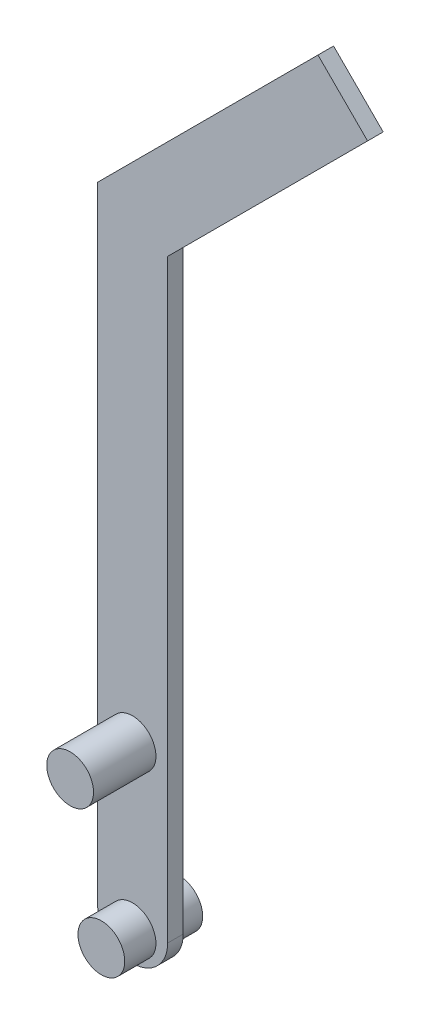
ISO-10303-21;
HEADER;
FILE_DESCRIPTION(('STEP AP214'),'2;1');
FILE_NAME('part.step','',(''),(''),'','','');
FILE_SCHEMA(('AUTOMOTIVE_DESIGN { 1 0 10303 214 1 1 1 1 }'));
ENDSEC;
DATA;
#1=APPLICATION_CONTEXT('core data for automotive mechanical design processes');
#2=APPLICATION_PROTOCOL_DEFINITION('international standard','automotive_design',2000,#1);
#3=PRODUCT_CONTEXT('',#1,'mechanical');
#4=PRODUCT('Part','Part','',(#3));
#5=PRODUCT_RELATED_PRODUCT_CATEGORY('part','',(#4));
#6=PRODUCT_DEFINITION_FORMATION('','',#4);
#7=PRODUCT_DEFINITION_CONTEXT('part definition',#1,'design');
#8=PRODUCT_DEFINITION('design','',#6,#7);
#9=PRODUCT_DEFINITION_SHAPE('','',#8);
#10=(LENGTH_UNIT() NAMED_UNIT(*) SI_UNIT(.MILLI.,.METRE.));
#11=(NAMED_UNIT(*) PLANE_ANGLE_UNIT() SI_UNIT($,.RADIAN.));
#12=(NAMED_UNIT(*) SI_UNIT($,.STERADIAN.) SOLID_ANGLE_UNIT());
#13=UNCERTAINTY_MEASURE_WITH_UNIT(LENGTH_MEASURE(1.E-05),#10,'distance_accuracy_value','');
#14=(GEOMETRIC_REPRESENTATION_CONTEXT(3) GLOBAL_UNCERTAINTY_ASSIGNED_CONTEXT((#13)) GLOBAL_UNIT_ASSIGNED_CONTEXT((#10,
#11,#12)) REPRESENTATION_CONTEXT('',''));
#15=CARTESIAN_POINT('',(0.,0.,0.));
#16=DIRECTION('',(0.,0.,1.));
#17=DIRECTION('',(1.,0.,0.));
#18=AXIS2_PLACEMENT_3D('',#15,#16,#17);
#19=CARTESIAN_POINT('',(-8.77973143237245,-137.007703282967,3.41623708948377));
#20=DIRECTION('',(0.,0.,-1.));
#21=DIRECTION('',(-1.,0.,0.));
#22=AXIS2_PLACEMENT_3D('',#19,#20,#21);
#23=CYLINDRICAL_SURFACE('',#22,15.75);
#24=CARTESIAN_POINT('',(-8.77973143237245,-137.007703282967,-3.58376291051623));
#25=DIRECTION('',(0.,0.,1.));
#26=DIRECTION('',(1.,0.,0.));
#27=AXIS2_PLACEMENT_3D('',#24,#25,#26);
#28=CIRCLE('',#27,15.75);
#29=CARTESIAN_POINT('',(-24.5297314323725,-137.007703282967,-3.58376291051623));
#30=VERTEX_POINT('',#29);
#31=CARTESIAN_POINT('',(6.97026856762755,-137.007703282967,-3.58376291051623));
#32=VERTEX_POINT('',#31);
#33=EDGE_CURVE('E109',#30,#32,#28,.T.);
#34=ORIENTED_EDGE('',*,*,#33,.T.);
#35=DIRECTION('',(0.,0.,-1.));
#36=VECTOR('',#35,1.);
#37=CARTESIAN_POINT('',(6.97026856762755,-137.007703282967,3.41623708948377));
#38=LINE('',#37,#36);
#39=CARTESIAN_POINT('',(6.97026856762755,-137.007703282967,3.41623708948377));
#40=VERTEX_POINT('',#39);
#41=EDGE_CURVE('E47',#40,#32,#38,.T.);
#42=ORIENTED_EDGE('',*,*,#41,.F.);
#43=CARTESIAN_POINT('',(-8.77973143237245,-137.007703282967,3.41623708948377));
#44=DIRECTION('',(0.,0.,1.));
#45=DIRECTION('',(1.,0.,0.));
#46=AXIS2_PLACEMENT_3D('',#43,#44,#45);
#47=CIRCLE('',#46,15.75);
#48=CARTESIAN_POINT('',(-24.5297314323725,-137.007703282967,3.41623708948377));
#49=VERTEX_POINT('',#48);
#50=EDGE_CURVE('E150',#49,#40,#47,.T.);
#51=ORIENTED_EDGE('',*,*,#50,.F.);
#52=DIRECTION('',(0.,0.,-1.));
#53=VECTOR('',#52,1.);
#54=CARTESIAN_POINT('',(-24.5297314323725,-137.007703282967,3.41623708948377));
#55=LINE('',#54,#53);
#56=EDGE_CURVE('E155',#49,#30,#55,.T.);
#57=ORIENTED_EDGE('',*,*,#56,.T.);
#58=EDGE_LOOP('',(#34,#42,#51,#57));
#59=FACE_BOUND('',#58,.T.);
#60=ADVANCED_FACE('F38',(#59),#23,.T.);
#61=CARTESIAN_POINT('',(6.97026856762755,-137.007703282967,3.41623708948377));
#62=DIRECTION('',(-1.,0.,0.));
#63=DIRECTION('',(0.,-1.,0.));
#64=AXIS2_PLACEMENT_3D('',#61,#62,#63);
#65=PLANE('',#64);
#66=DIRECTION('',(0.,1.,0.));
#67=VECTOR('',#66,1.);
#68=CARTESIAN_POINT('',(6.97026856762755,-137.007703282967,-3.58376291051623));
#69=LINE('',#68,#67);
#70=CARTESIAN_POINT('',(6.97026856762757,129.944569502281,-3.58376291051623));
#71=VERTEX_POINT('',#70);
#72=EDGE_CURVE('E68',#32,#71,#69,.T.);
#73=ORIENTED_EDGE('',*,*,#72,.T.);
#74=DIRECTION('',(0.,0.,1.));
#75=VECTOR('',#74,1.);
#76=CARTESIAN_POINT('',(6.97026856762757,129.944569502281,-3.58376291051623));
#77=LINE('',#76,#75);
#78=CARTESIAN_POINT('',(6.97026856762757,129.944569502281,3.41623708948377));
#79=VERTEX_POINT('',#78);
#80=EDGE_CURVE('E105',#71,#79,#77,.T.);
#81=ORIENTED_EDGE('',*,*,#80,.T.);
#82=DIRECTION('',(0.,1.,0.));
#83=VECTOR('',#82,1.);
#84=CARTESIAN_POINT('',(6.97026856762755,-137.007703282967,3.41623708948377));
#85=LINE('',#84,#83);
#86=EDGE_CURVE('E152',#40,#79,#85,.T.);
#87=ORIENTED_EDGE('',*,*,#86,.F.);
#88=ORIENTED_EDGE('',*,*,#41,.T.);
#89=EDGE_LOOP('',(#73,#81,#87,#88));
#90=FACE_BOUND('',#89,.T.);
#91=ADVANCED_FACE('F104',(#90),#65,.F.);
#92=CARTESIAN_POINT('',(-24.5297314323725,-137.007703282967,3.41623708948377));
#93=DIRECTION('',(1.,0.,0.));
#94=DIRECTION('',(0.,1.,0.));
#95=AXIS2_PLACEMENT_3D('',#92,#93,#94);
#96=PLANE('',#95);
#97=DIRECTION('',(0.,-1.,0.));
#98=VECTOR('',#97,1.);
#99=CARTESIAN_POINT('',(-24.5297314323725,-137.007703282967,-3.58376291051623));
#100=LINE('',#99,#98);
#101=CARTESIAN_POINT('',(-24.5297314323725,142.992296717033,-3.58376291051623));
#102=VERTEX_POINT('',#101);
#103=EDGE_CURVE('E99',#102,#30,#100,.T.);
#104=ORIENTED_EDGE('',*,*,#103,.T.);
#105=ORIENTED_EDGE('',*,*,#56,.F.);
#106=DIRECTION('',(0.,-1.,0.));
#107=VECTOR('',#106,1.);
#108=CARTESIAN_POINT('',(-24.5297314323725,-137.007703282967,3.41623708948377));
#109=LINE('',#108,#107);
#110=CARTESIAN_POINT('',(-24.5297314323725,142.992296717033,3.41623708948377));
#111=VERTEX_POINT('',#110);
#112=EDGE_CURVE('E56',#111,#49,#109,.T.);
#113=ORIENTED_EDGE('',*,*,#112,.F.);
#114=DIRECTION('',(0.,0.,1.));
#115=VECTOR('',#114,1.);
#116=CARTESIAN_POINT('',(-24.5297314323725,142.992296717033,-3.58376291051623));
#117=LINE('',#116,#115);
#118=EDGE_CURVE('E119',#102,#111,#117,.T.);
#119=ORIENTED_EDGE('',*,*,#118,.F.);
#120=EDGE_LOOP('',(#104,#105,#113,#119));
#121=FACE_BOUND('',#120,.T.);
#122=ADVANCED_FACE('F162',(#121),#96,.F.);
#123=CARTESIAN_POINT('',(-8.77973143237245,-137.007703282967,3.41623708948377));
#124=DIRECTION('',(0.,0.,1.));
#125=DIRECTION('',(1.,0.,0.));
#126=AXIS2_PLACEMENT_3D('',#123,#124,#125);
#127=PLANE('',#126);
#128=ORIENTED_EDGE('',*,*,#86,.T.);
#129=DIRECTION('',(0.707106781186549,0.707106781186546,0.));
#130=VECTOR('',#129,1.);
#131=CARTESIAN_POINT('',(6.97026856762757,129.944569502281,3.41623708948377));
#132=LINE('',#131,#130);
#133=CARTESIAN_POINT('',(96.7390815411207,219.713382475773,3.41623708948377));
#134=VERTEX_POINT('',#133);
#135=EDGE_CURVE('E117',#79,#134,#132,.T.);
#136=ORIENTED_EDGE('',*,*,#135,.T.);
#137=DIRECTION('',(-0.707106781186553,0.707106781186542,0.));
#138=VECTOR('',#137,1.);
#139=CARTESIAN_POINT('',(74.4652179337436,241.98724608315,3.41623708948377));
#140=LINE('',#139,#138);
#141=CARTESIAN_POINT('',(74.4652179337436,241.98724608315,3.41623708948377));
#142=VERTEX_POINT('',#141);
#143=EDGE_CURVE('E126',#134,#142,#140,.T.);
#144=ORIENTED_EDGE('',*,*,#143,.T.);
#145=DIRECTION('',(-0.707106781186544,-0.707106781186551,0.));
#146=VECTOR('',#145,1.);
#147=CARTESIAN_POINT('',(-24.5297314323725,142.992296717033,3.41623708948377));
#148=LINE('',#147,#146);
#149=EDGE_CURVE('E129',#142,#111,#148,.T.);
#150=ORIENTED_EDGE('',*,*,#149,.T.);
#151=ORIENTED_EDGE('',*,*,#112,.T.);
#152=ORIENTED_EDGE('',*,*,#50,.T.);
#153=EDGE_LOOP('',(#128,#136,#144,#150,#151,#152));
#154=FACE_BOUND('',#153,.T.);
#155=CARTESIAN_POINT('',(-8.77973143237245,-139.720327931283,3.41623708948377));
#156=DIRECTION('',(0.,0.,1.));
#157=DIRECTION('',(1.,0.,0.));
#158=AXIS2_PLACEMENT_3D('',#155,#156,#157);
#159=CIRCLE('',#158,10.5);
#160=CARTESIAN_POINT('',(1.72026856762755,-139.720327931283,3.41623708948377));
#161=VERTEX_POINT('',#160);
#162=EDGE_CURVE('E11',#161,#161,#159,.T.);
#163=ORIENTED_EDGE('',*,*,#162,.F.);
#164=EDGE_LOOP('',(#163));
#165=FACE_BOUND('',#164,.T.);
#166=CARTESIAN_POINT('',(-8.77973143237245,-67.0077032829671,3.41623708948377));
#167=DIRECTION('',(0.,0.,1.));
#168=DIRECTION('',(1.,0.,0.));
#169=AXIS2_PLACEMENT_3D('',#166,#167,#168);
#170=CIRCLE('',#169,10.5);
#171=CARTESIAN_POINT('',(1.72026856762755,-67.0077032829671,3.41623708948377));
#172=VERTEX_POINT('',#171);
#173=EDGE_CURVE('E147',#172,#172,#170,.T.);
#174=ORIENTED_EDGE('',*,*,#173,.F.);
#175=EDGE_LOOP('',(#174));
#176=FACE_BOUND('',#175,.T.);
#177=ADVANCED_FACE('F165',(#154,#165,#176),#127,.T.);
#178=CARTESIAN_POINT('',(-8.77973143237245,-137.007703282967,-3.58376291051623));
#179=DIRECTION('',(0.,0.,1.));
#180=DIRECTION('',(1.,0.,0.));
#181=AXIS2_PLACEMENT_3D('',#178,#179,#180);
#182=PLANE('',#181);
#183=CARTESIAN_POINT('',(-8.77973143237245,-139.720327931283,-3.58376291051623));
#184=DIRECTION('',(0.,0.,1.));
#185=DIRECTION('',(1.,0.,0.));
#186=AXIS2_PLACEMENT_3D('',#183,#184,#185);
#187=CIRCLE('',#186,10.5);
#188=CARTESIAN_POINT('',(1.72026856762755,-139.720327931283,-3.58376291051623));
#189=VERTEX_POINT('',#188);
#190=EDGE_CURVE('E41',#189,#189,#187,.T.);
#191=ORIENTED_EDGE('',*,*,#190,.T.);
#192=EDGE_LOOP('',(#191));
#193=FACE_BOUND('',#192,.T.);
#194=ORIENTED_EDGE('',*,*,#103,.F.);
#195=DIRECTION('',(-0.707106781186544,-0.707106781186551,0.));
#196=VECTOR('',#195,1.);
#197=CARTESIAN_POINT('',(-24.5297314323725,142.992296717033,-3.58376291051623));
#198=LINE('',#197,#196);
#199=CARTESIAN_POINT('',(74.4652179337436,241.98724608315,-3.58376291051623));
#200=VERTEX_POINT('',#199);
#201=EDGE_CURVE('E123',#200,#102,#198,.T.);
#202=ORIENTED_EDGE('',*,*,#201,.F.);
#203=DIRECTION('',(-0.707106781186553,0.707106781186542,0.));
#204=VECTOR('',#203,1.);
#205=CARTESIAN_POINT('',(74.4652179337436,241.98724608315,-3.58376291051623));
#206=LINE('',#205,#204);
#207=CARTESIAN_POINT('',(96.7390815411207,219.713382475773,-3.58376291051623));
#208=VERTEX_POINT('',#207);
#209=EDGE_CURVE('E122',#208,#200,#206,.T.);
#210=ORIENTED_EDGE('',*,*,#209,.F.);
#211=DIRECTION('',(0.707106781186549,0.707106781186546,0.));
#212=VECTOR('',#211,1.);
#213=CARTESIAN_POINT('',(6.97026856762757,129.944569502281,-3.58376291051623));
#214=LINE('',#213,#212);
#215=EDGE_CURVE('E114',#71,#208,#214,.T.);
#216=ORIENTED_EDGE('',*,*,#215,.F.);
#217=ORIENTED_EDGE('',*,*,#72,.F.);
#218=ORIENTED_EDGE('',*,*,#33,.F.);
#219=EDGE_LOOP('',(#194,#202,#210,#216,#217,#218));
#220=FACE_BOUND('',#219,.T.);
#221=ADVANCED_FACE('F121',(#193,#220),#182,.F.);
#222=CARTESIAN_POINT('',(-8.77973143237245,-67.0077032829671,31.4162370894838));
#223=DIRECTION('',(0.,0.,-1.));
#224=DIRECTION('',(-1.,0.,0.));
#225=AXIS2_PLACEMENT_3D('',#222,#223,#224);
#226=CYLINDRICAL_SURFACE('',#225,10.5);
#227=CARTESIAN_POINT('',(-8.77973143237245,-67.0077032829671,31.4162370894838));
#228=DIRECTION('',(0.,0.,1.));
#229=DIRECTION('',(1.,0.,0.));
#230=AXIS2_PLACEMENT_3D('',#227,#228,#229);
#231=CIRCLE('',#230,10.5);
#232=CARTESIAN_POINT('',(1.72026856762755,-67.0077032829671,31.4162370894838));
#233=VERTEX_POINT('',#232);
#234=EDGE_CURVE('E144',#233,#233,#231,.T.);
#235=ORIENTED_EDGE('',*,*,#234,.F.);
#236=EDGE_LOOP('',(#235));
#237=FACE_BOUND('',#236,.T.);
#238=ORIENTED_EDGE('',*,*,#173,.T.);
#239=EDGE_LOOP('',(#238));
#240=FACE_BOUND('',#239,.T.);
#241=ADVANCED_FACE('F173',(#237,#240),#226,.T.);
#242=CARTESIAN_POINT('',(-8.77973143237245,-67.0077032829671,31.4162370894838));
#243=DIRECTION('',(0.,0.,1.));
#244=DIRECTION('',(1.,0.,0.));
#245=AXIS2_PLACEMENT_3D('',#242,#243,#244);
#246=PLANE('',#245);
#247=ORIENTED_EDGE('',*,*,#234,.T.);
#248=EDGE_LOOP('',(#247));
#249=FACE_BOUND('',#248,.T.);
#250=ADVANCED_FACE('F175',(#249),#246,.T.);
#251=CARTESIAN_POINT('',(-8.77973143237245,-139.720327931283,-17.5837629105162));
#252=DIRECTION('',(0.,0.,1.));
#253=DIRECTION('',(1.,0.,0.));
#254=AXIS2_PLACEMENT_3D('',#251,#252,#253);
#255=PLANE('',#254);
#256=CARTESIAN_POINT('',(-8.77973143237245,-139.720327931283,-17.5837629105162));
#257=DIRECTION('',(0.,0.,1.));
#258=DIRECTION('',(1.,0.,0.));
#259=AXIS2_PLACEMENT_3D('',#256,#257,#258);
#260=CIRCLE('',#259,10.5);
#261=CARTESIAN_POINT('',(1.72026856762755,-139.720327931283,-17.5837629105162));
#262=VERTEX_POINT('',#261);
#263=EDGE_CURVE('E141',#262,#262,#260,.T.);
#264=ORIENTED_EDGE('',*,*,#263,.F.);
#265=EDGE_LOOP('',(#264));
#266=FACE_BOUND('',#265,.T.);
#267=ADVANCED_FACE('F182',(#266),#255,.F.);
#268=CARTESIAN_POINT('',(-8.77973143237245,-139.720327931283,-17.5837629105162));
#269=DIRECTION('',(0.,0.,1.));
#270=DIRECTION('',(1.,0.,0.));
#271=AXIS2_PLACEMENT_3D('',#268,#269,#270);
#272=CYLINDRICAL_SURFACE('',#271,10.5);
#273=ORIENTED_EDGE('',*,*,#263,.T.);
#274=EDGE_LOOP('',(#273));
#275=FACE_BOUND('',#274,.T.);
#276=ORIENTED_EDGE('',*,*,#190,.F.);
#277=EDGE_LOOP('',(#276));
#278=FACE_BOUND('',#277,.T.);
#279=ADVANCED_FACE('F229',(#275,#278),#272,.T.);
#280=ORIENTED_EDGE('',*,*,#162,.T.);
#281=EDGE_LOOP('',(#280));
#282=FACE_BOUND('',#281,.T.);
#283=CARTESIAN_POINT('',(-8.77973143237245,-139.720327931283,17.4162370894838));
#284=DIRECTION('',(0.,0.,1.));
#285=DIRECTION('',(1.,0.,0.));
#286=AXIS2_PLACEMENT_3D('',#283,#284,#285);
#287=CIRCLE('',#286,10.5);
#288=CARTESIAN_POINT('',(1.72026856762755,-139.720327931283,17.4162370894838));
#289=VERTEX_POINT('',#288);
#290=EDGE_CURVE('E135',#289,#289,#287,.T.);
#291=ORIENTED_EDGE('',*,*,#290,.F.);
#292=EDGE_LOOP('',(#291));
#293=FACE_BOUND('',#292,.T.);
#294=ADVANCED_FACE('F240',(#282,#293),#272,.T.);
#295=CARTESIAN_POINT('',(-8.77973143237245,-139.720327931283,17.4162370894838));
#296=DIRECTION('',(0.,0.,1.));
#297=DIRECTION('',(1.,0.,0.));
#298=AXIS2_PLACEMENT_3D('',#295,#296,#297);
#299=PLANE('',#298);
#300=ORIENTED_EDGE('',*,*,#290,.T.);
#301=EDGE_LOOP('',(#300));
#302=FACE_BOUND('',#301,.T.);
#303=ADVANCED_FACE('F251',(#302),#299,.T.);
#304=CARTESIAN_POINT('',(-24.5297314323725,142.992296717033,-3.58376291051623));
#305=DIRECTION('',(-0.707106781186551,0.707106781186544,0.));
#306=DIRECTION('',(-0.707106781186544,-0.707106781186551,0.));
#307=AXIS2_PLACEMENT_3D('',#304,#305,#306);
#308=PLANE('',#307);
#309=ORIENTED_EDGE('',*,*,#149,.F.);
#310=DIRECTION('',(0.,0.,1.));
#311=VECTOR('',#310,1.);
#312=CARTESIAN_POINT('',(74.4652179337436,241.98724608315,-3.58376291051623));
#313=LINE('',#312,#311);
#314=EDGE_CURVE('E78',#200,#142,#313,.T.);
#315=ORIENTED_EDGE('',*,*,#314,.F.);
#316=ORIENTED_EDGE('',*,*,#201,.T.);
#317=ORIENTED_EDGE('',*,*,#118,.T.);
#318=EDGE_LOOP('',(#309,#315,#316,#317));
#319=FACE_BOUND('',#318,.T.);
#320=ADVANCED_FACE('F163',(#319),#308,.T.);
#321=CARTESIAN_POINT('',(74.4652179337436,241.98724608315,-3.58376291051623));
#322=DIRECTION('',(0.707106781186542,0.707106781186553,0.));
#323=DIRECTION('',(-0.707106781186553,0.707106781186542,0.));
#324=AXIS2_PLACEMENT_3D('',#321,#322,#323);
#325=PLANE('',#324);
#326=ORIENTED_EDGE('',*,*,#143,.F.);
#327=DIRECTION('',(0.,0.,1.));
#328=VECTOR('',#327,1.);
#329=CARTESIAN_POINT('',(96.7390815411207,219.713382475773,-3.58376291051623));
#330=LINE('',#329,#328);
#331=EDGE_CURVE('E118',#208,#134,#330,.T.);
#332=ORIENTED_EDGE('',*,*,#331,.F.);
#333=ORIENTED_EDGE('',*,*,#209,.T.);
#334=ORIENTED_EDGE('',*,*,#314,.T.);
#335=EDGE_LOOP('',(#326,#332,#333,#334));
#336=FACE_BOUND('',#335,.T.);
#337=ADVANCED_FACE('F164',(#336),#325,.T.);
#338=CARTESIAN_POINT('',(6.97026856762757,129.944569502281,-3.58376291051623));
#339=DIRECTION('',(0.707106781186546,-0.707106781186549,0.));
#340=DIRECTION('',(0.707106781186549,0.707106781186546,0.));
#341=AXIS2_PLACEMENT_3D('',#338,#339,#340);
#342=PLANE('',#341);
#343=ORIENTED_EDGE('',*,*,#135,.F.);
#344=ORIENTED_EDGE('',*,*,#80,.F.);
#345=ORIENTED_EDGE('',*,*,#215,.T.);
#346=ORIENTED_EDGE('',*,*,#331,.T.);
#347=EDGE_LOOP('',(#343,#344,#345,#346));
#348=FACE_BOUND('',#347,.T.);
#349=ADVANCED_FACE('F113',(#348),#342,.T.);
#350=CLOSED_SHELL('',(#60,#91,#122,#177,#221,#241,#250,#267,#279,#294,#303,#320,#337,#349));
#351=MANIFOLD_SOLID_BREP('B2',#350);
#352=ADVANCED_BREP_SHAPE_REPRESENTATION('',(#18,#351),#14);
#353=SHAPE_DEFINITION_REPRESENTATION(#9,#352);
ENDSEC;
END-ISO-10303-21;
